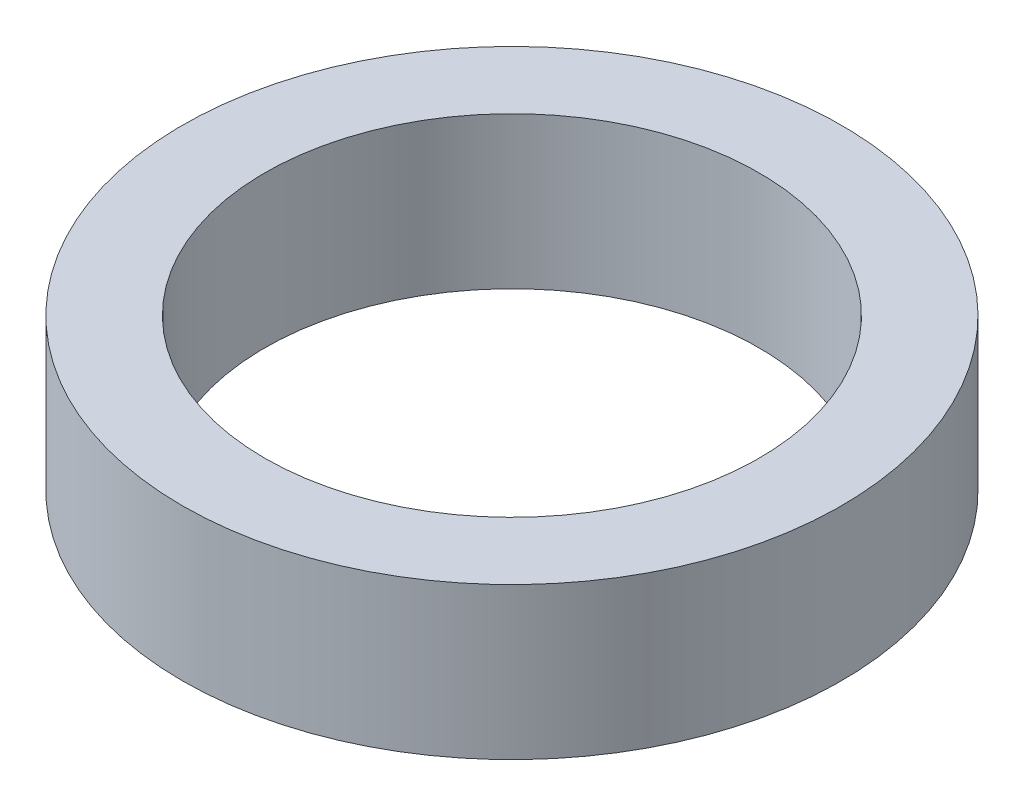
ISO-10303-21;
HEADER;
FILE_DESCRIPTION(('STEP AP214'),'2;1');
FILE_NAME('part.step','',(''),(''),'','','');
FILE_SCHEMA(('AUTOMOTIVE_DESIGN { 1 0 10303 214 1 1 1 1 }'));
ENDSEC;
DATA;
#1=APPLICATION_CONTEXT('core data for automotive mechanical design processes');
#2=APPLICATION_PROTOCOL_DEFINITION('international standard','automotive_design',2000,#1);
#3=PRODUCT_CONTEXT('',#1,'mechanical');
#4=PRODUCT('Part','Part','',(#3));
#5=PRODUCT_RELATED_PRODUCT_CATEGORY('part','',(#4));
#6=PRODUCT_DEFINITION_FORMATION('','',#4);
#7=PRODUCT_DEFINITION_CONTEXT('part definition',#1,'design');
#8=PRODUCT_DEFINITION('design','',#6,#7);
#9=PRODUCT_DEFINITION_SHAPE('','',#8);
#10=(LENGTH_UNIT() NAMED_UNIT(*) SI_UNIT(.MILLI.,.METRE.));
#11=(NAMED_UNIT(*) PLANE_ANGLE_UNIT() SI_UNIT($,.RADIAN.));
#12=(NAMED_UNIT(*) SI_UNIT($,.STERADIAN.) SOLID_ANGLE_UNIT());
#13=UNCERTAINTY_MEASURE_WITH_UNIT(LENGTH_MEASURE(1.E-05),#10,'distance_accuracy_value','');
#14=(GEOMETRIC_REPRESENTATION_CONTEXT(3) GLOBAL_UNCERTAINTY_ASSIGNED_CONTEXT((#13)) GLOBAL_UNIT_ASSIGNED_CONTEXT((#10,
#11,#12)) REPRESENTATION_CONTEXT('',''));
#15=CARTESIAN_POINT('',(0.,0.,0.));
#16=DIRECTION('',(0.,0.,1.));
#17=DIRECTION('',(1.,0.,0.));
#18=AXIS2_PLACEMENT_3D('',#15,#16,#17);
#19=CARTESIAN_POINT('',(0.,23.,0.));
#20=DIRECTION('',(0.,-1.,0.));
#21=DIRECTION('',(0.,0.,-1.));
#22=AXIS2_PLACEMENT_3D('',#19,#20,#21);
#23=CYLINDRICAL_SURFACE('',#22,50.);
#24=CARTESIAN_POINT('',(0.,23.,0.));
#25=DIRECTION('',(0.,1.,0.));
#26=DIRECTION('',(0.,0.,1.));
#27=AXIS2_PLACEMENT_3D('',#24,#25,#26);
#28=CIRCLE('',#27,50.);
#29=CARTESIAN_POINT('',(0.,23.,50.));
#30=VERTEX_POINT('',#29);
#31=EDGE_CURVE('E10',#30,#30,#28,.T.);
#32=ORIENTED_EDGE('',*,*,#31,.F.);
#33=EDGE_LOOP('',(#32));
#34=FACE_BOUND('',#33,.T.);
#35=CARTESIAN_POINT('',(0.,0.,0.));
#36=DIRECTION('',(0.,1.,0.));
#37=DIRECTION('',(0.,0.,1.));
#38=AXIS2_PLACEMENT_3D('',#35,#36,#37);
#39=CIRCLE('',#38,50.);
#40=CARTESIAN_POINT('',(0.,0.,50.));
#41=VERTEX_POINT('',#40);
#42=EDGE_CURVE('E37',#41,#41,#39,.T.);
#43=ORIENTED_EDGE('',*,*,#42,.T.);
#44=EDGE_LOOP('',(#43));
#45=FACE_BOUND('',#44,.T.);
#46=ADVANCED_FACE('F40',(#34,#45),#23,.T.);
#47=CARTESIAN_POINT('',(0.,23.,0.));
#48=DIRECTION('',(0.,1.,0.));
#49=DIRECTION('',(0.,0.,1.));
#50=AXIS2_PLACEMENT_3D('',#47,#48,#49);
#51=PLANE('',#50);
#52=CARTESIAN_POINT('',(0.,23.,0.));
#53=DIRECTION('',(0.,1.,0.));
#54=DIRECTION('',(0.,0.,1.));
#55=AXIS2_PLACEMENT_3D('',#52,#53,#54);
#56=CIRCLE('',#55,37.5);
#57=CARTESIAN_POINT('',(0.,23.,37.5));
#58=VERTEX_POINT('',#57);
#59=EDGE_CURVE('E50',#58,#58,#56,.T.);
#60=ORIENTED_EDGE('',*,*,#59,.F.);
#61=EDGE_LOOP('',(#60));
#62=FACE_BOUND('',#61,.T.);
#63=ORIENTED_EDGE('',*,*,#31,.T.);
#64=EDGE_LOOP('',(#63));
#65=FACE_BOUND('',#64,.T.);
#66=ADVANCED_FACE('F59',(#62,#65),#51,.T.);
#67=CARTESIAN_POINT('',(0.,0.,0.));
#68=DIRECTION('',(0.,1.,0.));
#69=DIRECTION('',(0.,0.,1.));
#70=AXIS2_PLACEMENT_3D('',#67,#68,#69);
#71=PLANE('',#70);
#72=CARTESIAN_POINT('',(0.,0.,0.));
#73=DIRECTION('',(0.,1.,0.));
#74=DIRECTION('',(0.,0.,1.));
#75=AXIS2_PLACEMENT_3D('',#72,#73,#74);
#76=CIRCLE('',#75,37.5);
#77=CARTESIAN_POINT('',(0.,0.,37.5));
#78=VERTEX_POINT('',#77);
#79=EDGE_CURVE('E47',#78,#78,#76,.T.);
#80=ORIENTED_EDGE('',*,*,#79,.T.);
#81=EDGE_LOOP('',(#80));
#82=FACE_BOUND('',#81,.T.);
#83=ORIENTED_EDGE('',*,*,#42,.F.);
#84=EDGE_LOOP('',(#83));
#85=FACE_BOUND('',#84,.T.);
#86=ADVANCED_FACE('F58',(#82,#85),#71,.F.);
#87=CARTESIAN_POINT('',(0.,23.,0.));
#88=DIRECTION('',(0.,-1.,0.));
#89=DIRECTION('',(0.,0.,-1.));
#90=AXIS2_PLACEMENT_3D('',#87,#88,#89);
#91=CYLINDRICAL_SURFACE('',#90,37.5);
#92=ORIENTED_EDGE('',*,*,#59,.T.);
#93=EDGE_LOOP('',(#92));
#94=FACE_BOUND('',#93,.T.);
#95=ORIENTED_EDGE('',*,*,#79,.F.);
#96=EDGE_LOOP('',(#95));
#97=FACE_BOUND('',#96,.T.);
#98=ADVANCED_FACE('F54',(#94,#97),#91,.F.);
#99=CLOSED_SHELL('',(#46,#66,#86,#98));
#100=MANIFOLD_SOLID_BREP('B2',#99);
#101=ADVANCED_BREP_SHAPE_REPRESENTATION('',(#18,#100),#14);
#102=SHAPE_DEFINITION_REPRESENTATION(#9,#101);
ENDSEC;
END-ISO-10303-21;
